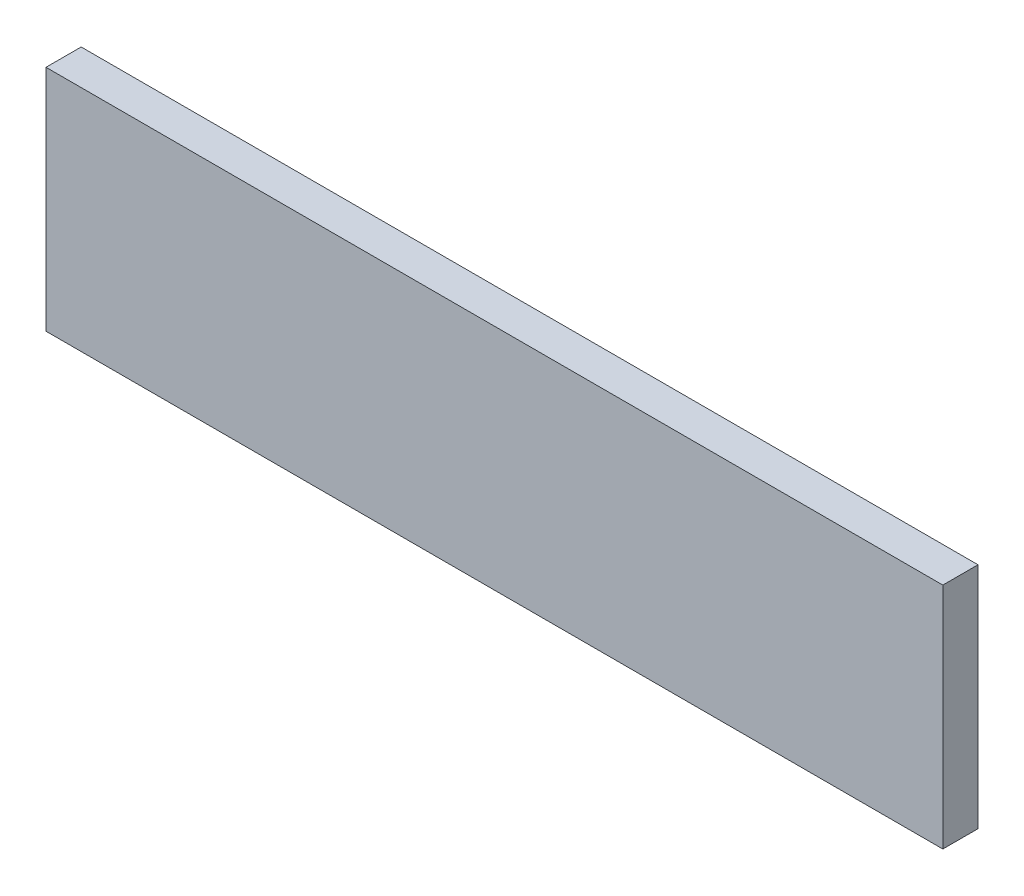
ISO-10303-21;
HEADER;
FILE_DESCRIPTION(('STEP AP214'),'2;1');
FILE_NAME('part.step','',(''),(''),'','','');
FILE_SCHEMA(('AUTOMOTIVE_DESIGN { 1 0 10303 214 1 1 1 1 }'));
ENDSEC;
DATA;
#1=APPLICATION_CONTEXT('core data for automotive mechanical design processes');
#2=APPLICATION_PROTOCOL_DEFINITION('international standard','automotive_design',2000,#1);
#3=PRODUCT_CONTEXT('',#1,'mechanical');
#4=PRODUCT('Part','Part','',(#3));
#5=PRODUCT_RELATED_PRODUCT_CATEGORY('part','',(#4));
#6=PRODUCT_DEFINITION_FORMATION('','',#4);
#7=PRODUCT_DEFINITION_CONTEXT('part definition',#1,'design');
#8=PRODUCT_DEFINITION('design','',#6,#7);
#9=PRODUCT_DEFINITION_SHAPE('','',#8);
#10=(LENGTH_UNIT() NAMED_UNIT(*) SI_UNIT(.MILLI.,.METRE.));
#11=(NAMED_UNIT(*) PLANE_ANGLE_UNIT() SI_UNIT($,.RADIAN.));
#12=(NAMED_UNIT(*) SI_UNIT($,.STERADIAN.) SOLID_ANGLE_UNIT());
#13=UNCERTAINTY_MEASURE_WITH_UNIT(LENGTH_MEASURE(1.E-05),#10,'distance_accuracy_value','');
#14=(GEOMETRIC_REPRESENTATION_CONTEXT(3) GLOBAL_UNCERTAINTY_ASSIGNED_CONTEXT((#13)) GLOBAL_UNIT_ASSIGNED_CONTEXT((#10,
#11,#12)) REPRESENTATION_CONTEXT('',''));
#15=CARTESIAN_POINT('',(0.,0.,0.));
#16=DIRECTION('',(0.,0.,1.));
#17=DIRECTION('',(1.,0.,0.));
#18=AXIS2_PLACEMENT_3D('',#15,#16,#17);
#19=CARTESIAN_POINT('',(-0.25500076,0.06500114000001,0.));
#20=DIRECTION('',(0.,0.,1.));
#21=DIRECTION('',(1.,0.,0.));
#22=AXIS2_PLACEMENT_3D('',#19,#20,#21);
#23=PLANE('',#22);
#24=DIRECTION('',(0.,1.,0.));
#25=VECTOR('',#24,1.);
#26=CARTESIAN_POINT('',(0.25500076,0.06500114000001,0.));
#27=LINE('',#26,#25);
#28=CARTESIAN_POINT('',(0.25500076,-0.0649986,0.));
#29=VERTEX_POINT('',#28);
#30=CARTESIAN_POINT('',(0.25500076,0.06500114000001,0.));
#31=VERTEX_POINT('',#30);
#32=EDGE_CURVE('E45',#29,#31,#27,.T.);
#33=ORIENTED_EDGE('',*,*,#32,.F.);
#34=DIRECTION('',(1.,0.,0.));
#35=VECTOR('',#34,1.);
#36=CARTESIAN_POINT('',(-0.25500076,-0.0649986,0.));
#37=LINE('',#36,#35);
#38=CARTESIAN_POINT('',(-0.25500076,-0.0649986,0.));
#39=VERTEX_POINT('',#38);
#40=EDGE_CURVE('E75',#39,#29,#37,.T.);
#41=ORIENTED_EDGE('',*,*,#40,.F.);
#42=DIRECTION('',(0.,-1.,0.));
#43=VECTOR('',#42,1.);
#44=CARTESIAN_POINT('',(-0.25500076,0.06500114000001,0.));
#45=LINE('',#44,#43);
#46=CARTESIAN_POINT('',(-0.25500076,0.06500114000001,0.));
#47=VERTEX_POINT('',#46);
#48=EDGE_CURVE('E73',#47,#39,#45,.T.);
#49=ORIENTED_EDGE('',*,*,#48,.F.);
#50=DIRECTION('',(-1.,0.,0.));
#51=VECTOR('',#50,1.);
#52=CARTESIAN_POINT('',(-0.25500076,0.06500114000001,0.));
#53=LINE('',#52,#51);
#54=EDGE_CURVE('E11',#31,#47,#53,.T.);
#55=ORIENTED_EDGE('',*,*,#54,.F.);
#56=EDGE_LOOP('',(#33,#41,#49,#55));
#57=FACE_BOUND('',#56,.T.);
#58=ADVANCED_FACE('F17',(#57),#23,.F.);
#59=CARTESIAN_POINT('',(-0.25500076,0.06500114000001,0.));
#60=DIRECTION('',(0.,1.,0.));
#61=DIRECTION('',(1.,0.,0.));
#62=AXIS2_PLACEMENT_3D('',#59,#60,#61);
#63=PLANE('',#62);
#64=DIRECTION('',(0.,0.,-1.));
#65=VECTOR('',#64,1.);
#66=CARTESIAN_POINT('',(0.25500076,0.06500114000001,0.));
#67=LINE('',#66,#65);
#68=CARTESIAN_POINT('',(0.25500076,0.06500114000001,0.02));
#69=VERTEX_POINT('',#68);
#70=EDGE_CURVE('E25',#69,#31,#67,.T.);
#71=ORIENTED_EDGE('',*,*,#70,.T.);
#72=ORIENTED_EDGE('',*,*,#54,.T.);
#73=DIRECTION('',(0.,0.,1.));
#74=VECTOR('',#73,1.);
#75=CARTESIAN_POINT('',(-0.25500076,0.06500114000001,0.));
#76=LINE('',#75,#74);
#77=CARTESIAN_POINT('',(-0.25500076,0.06500114000001,0.02));
#78=VERTEX_POINT('',#77);
#79=EDGE_CURVE('E70',#47,#78,#76,.T.);
#80=ORIENTED_EDGE('',*,*,#79,.T.);
#81=DIRECTION('',(1.,0.,0.));
#82=VECTOR('',#81,1.);
#83=CARTESIAN_POINT('',(-0.25500076,0.06500114000001,0.02));
#84=LINE('',#83,#82);
#85=EDGE_CURVE('E135',#78,#69,#84,.T.);
#86=ORIENTED_EDGE('',*,*,#85,.T.);
#87=EDGE_LOOP('',(#71,#72,#80,#86));
#88=FACE_BOUND('',#87,.T.);
#89=ADVANCED_FACE('F67',(#88),#63,.T.);
#90=CARTESIAN_POINT('',(0.25500076,0.06500114000001,0.));
#91=DIRECTION('',(1.,0.,0.));
#92=DIRECTION('',(0.,1.,0.));
#93=AXIS2_PLACEMENT_3D('',#90,#91,#92);
#94=PLANE('',#93);
#95=DIRECTION('',(0.,0.,-1.));
#96=VECTOR('',#95,1.);
#97=CARTESIAN_POINT('',(0.25500076,-0.0649986,0.));
#98=LINE('',#97,#96);
#99=CARTESIAN_POINT('',(0.25500076,-0.0649986,0.02));
#100=VERTEX_POINT('',#99);
#101=EDGE_CURVE('E96',#100,#29,#98,.T.);
#102=ORIENTED_EDGE('',*,*,#101,.T.);
#103=ORIENTED_EDGE('',*,*,#32,.T.);
#104=ORIENTED_EDGE('',*,*,#70,.F.);
#105=DIRECTION('',(0.,-1.,0.));
#106=VECTOR('',#105,1.);
#107=CARTESIAN_POINT('',(0.25500076,0.06500114000001,0.02));
#108=LINE('',#107,#106);
#109=EDGE_CURVE('E139',#69,#100,#108,.T.);
#110=ORIENTED_EDGE('',*,*,#109,.T.);
#111=EDGE_LOOP('',(#102,#103,#104,#110));
#112=FACE_BOUND('',#111,.T.);
#113=ADVANCED_FACE('F152',(#112),#94,.T.);
#114=CARTESIAN_POINT('',(0.25500076,-0.0649986,0.));
#115=DIRECTION('',(0.,-1.,0.));
#116=DIRECTION('',(0.,0.,-1.));
#117=AXIS2_PLACEMENT_3D('',#114,#115,#116);
#118=PLANE('',#117);
#119=DIRECTION('',(0.,0.,-1.));
#120=VECTOR('',#119,1.);
#121=CARTESIAN_POINT('',(-0.25500076,-0.0649986,0.));
#122=LINE('',#121,#120);
#123=CARTESIAN_POINT('',(-0.25500076,-0.0649986,0.02));
#124=VERTEX_POINT('',#123);
#125=EDGE_CURVE('E79',#124,#39,#122,.T.);
#126=ORIENTED_EDGE('',*,*,#125,.T.);
#127=ORIENTED_EDGE('',*,*,#40,.T.);
#128=ORIENTED_EDGE('',*,*,#101,.F.);
#129=DIRECTION('',(-1.,0.,0.));
#130=VECTOR('',#129,1.);
#131=CARTESIAN_POINT('',(0.25500076,-0.0649986,0.02));
#132=LINE('',#131,#130);
#133=EDGE_CURVE('E86',#100,#124,#132,.T.);
#134=ORIENTED_EDGE('',*,*,#133,.T.);
#135=EDGE_LOOP('',(#126,#127,#128,#134));
#136=FACE_BOUND('',#135,.T.);
#137=ADVANCED_FACE('F157',(#136),#118,.T.);
#138=CARTESIAN_POINT('',(-0.25500076,-0.0649986,0.));
#139=DIRECTION('',(-1.,0.,0.));
#140=DIRECTION('',(0.,0.,1.));
#141=AXIS2_PLACEMENT_3D('',#138,#139,#140);
#142=PLANE('',#141);
#143=ORIENTED_EDGE('',*,*,#79,.F.);
#144=ORIENTED_EDGE('',*,*,#48,.T.);
#145=ORIENTED_EDGE('',*,*,#125,.F.);
#146=DIRECTION('',(0.,1.,0.));
#147=VECTOR('',#146,1.);
#148=CARTESIAN_POINT('',(-0.25500076,-0.0649986,0.02));
#149=LINE('',#148,#147);
#150=EDGE_CURVE('E83',#124,#78,#149,.T.);
#151=ORIENTED_EDGE('',*,*,#150,.T.);
#152=EDGE_LOOP('',(#143,#144,#145,#151));
#153=FACE_BOUND('',#152,.T.);
#154=ADVANCED_FACE('F81',(#153),#142,.T.);
#155=CARTESIAN_POINT('',(-0.25500076,0.06500114000001,0.02));
#156=DIRECTION('',(0.,0.,1.));
#157=DIRECTION('',(1.,0.,0.));
#158=AXIS2_PLACEMENT_3D('',#155,#156,#157);
#159=PLANE('',#158);
#160=ORIENTED_EDGE('',*,*,#109,.F.);
#161=ORIENTED_EDGE('',*,*,#85,.F.);
#162=ORIENTED_EDGE('',*,*,#150,.F.);
#163=ORIENTED_EDGE('',*,*,#133,.F.);
#164=EDGE_LOOP('',(#160,#161,#162,#163));
#165=FACE_BOUND('',#164,.T.);
#166=ADVANCED_FACE('F155',(#165),#159,.T.);
#167=CLOSED_SHELL('',(#58,#89,#113,#137,#154,#166));
#168=MANIFOLD_SOLID_BREP('B1',#167);
#169=ADVANCED_BREP_SHAPE_REPRESENTATION('',(#18,#168),#14);
#170=SHAPE_DEFINITION_REPRESENTATION(#9,#169);
ENDSEC;
END-ISO-10303-21;
